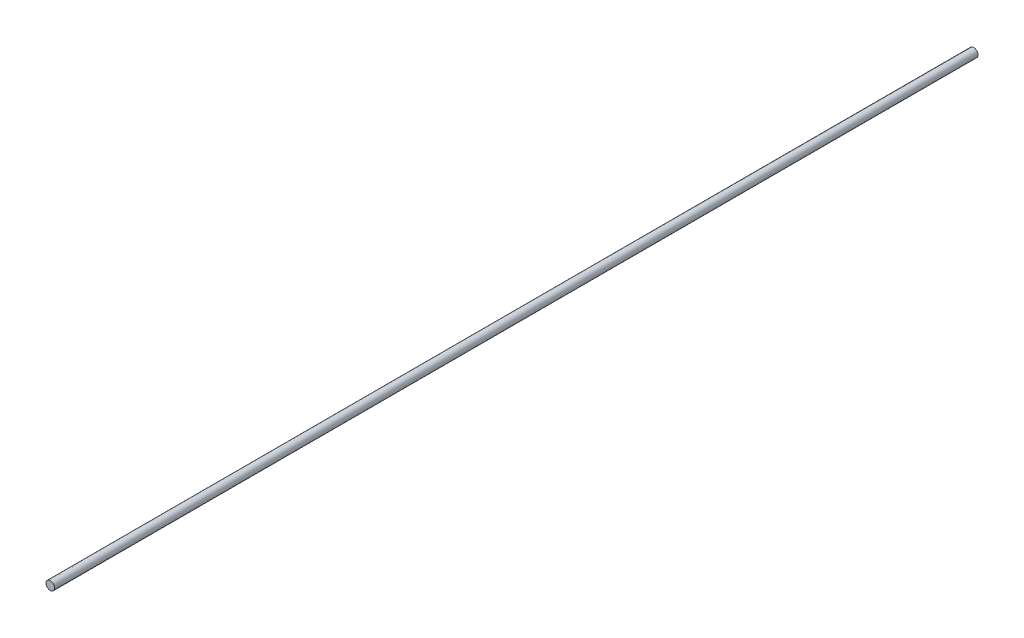
ISO-10303-21;
HEADER;
FILE_DESCRIPTION(('STEP AP214'),'2;1');
FILE_NAME('part.step','',(''),(''),'','','');
FILE_SCHEMA(('AUTOMOTIVE_DESIGN { 1 0 10303 214 1 1 1 1 }'));
ENDSEC;
DATA;
#1=APPLICATION_CONTEXT('core data for automotive mechanical design processes');
#2=APPLICATION_PROTOCOL_DEFINITION('international standard','automotive_design',2000,#1);
#3=PRODUCT_CONTEXT('',#1,'mechanical');
#4=PRODUCT('Part','Part','',(#3));
#5=PRODUCT_RELATED_PRODUCT_CATEGORY('part','',(#4));
#6=PRODUCT_DEFINITION_FORMATION('','',#4);
#7=PRODUCT_DEFINITION_CONTEXT('part definition',#1,'design');
#8=PRODUCT_DEFINITION('design','',#6,#7);
#9=PRODUCT_DEFINITION_SHAPE('','',#8);
#10=(LENGTH_UNIT() NAMED_UNIT(*) SI_UNIT(.MILLI.,.METRE.));
#11=(NAMED_UNIT(*) PLANE_ANGLE_UNIT() SI_UNIT($,.RADIAN.));
#12=(NAMED_UNIT(*) SI_UNIT($,.STERADIAN.) SOLID_ANGLE_UNIT());
#13=UNCERTAINTY_MEASURE_WITH_UNIT(LENGTH_MEASURE(1.E-05),#10,'distance_accuracy_value','');
#14=(GEOMETRIC_REPRESENTATION_CONTEXT(3) GLOBAL_UNCERTAINTY_ASSIGNED_CONTEXT((#13)) GLOBAL_UNIT_ASSIGNED_CONTEXT((#10,
#11,#12)) REPRESENTATION_CONTEXT('',''));
#15=CARTESIAN_POINT('',(0.,0.,0.));
#16=DIRECTION('',(0.,0.,1.));
#17=DIRECTION('',(1.,0.,0.));
#18=AXIS2_PLACEMENT_3D('',#15,#16,#17);
#19=CARTESIAN_POINT('',(0.,0.,1615.));
#20=DIRECTION('',(0.,0.,-1.));
#21=DIRECTION('',(-1.,0.,0.));
#22=AXIS2_PLACEMENT_3D('',#19,#20,#21);
#23=CYLINDRICAL_SURFACE('',#22,7.5);
#24=CARTESIAN_POINT('',(0.,0.,1615.));
#25=DIRECTION('',(0.,0.,1.));
#26=DIRECTION('',(1.,0.,0.));
#27=AXIS2_PLACEMENT_3D('',#24,#25,#26);
#28=CIRCLE('',#27,7.5);
#29=CARTESIAN_POINT('',(7.5,0.,1615.));
#30=VERTEX_POINT('',#29);
#31=EDGE_CURVE('E10',#30,#30,#28,.T.);
#32=ORIENTED_EDGE('',*,*,#31,.F.);
#33=EDGE_LOOP('',(#32));
#34=FACE_BOUND('',#33,.T.);
#35=CARTESIAN_POINT('',(0.,0.,0.));
#36=DIRECTION('',(0.,0.,1.));
#37=DIRECTION('',(1.,0.,0.));
#38=AXIS2_PLACEMENT_3D('',#35,#36,#37);
#39=CIRCLE('',#38,7.5);
#40=CARTESIAN_POINT('',(7.5,0.,0.));
#41=VERTEX_POINT('',#40);
#42=EDGE_CURVE('E35',#41,#41,#39,.T.);
#43=ORIENTED_EDGE('',*,*,#42,.T.);
#44=EDGE_LOOP('',(#43));
#45=FACE_BOUND('',#44,.T.);
#46=ADVANCED_FACE('F32',(#34,#45),#23,.T.);
#47=CARTESIAN_POINT('',(0.,0.,1615.));
#48=DIRECTION('',(0.,0.,1.));
#49=DIRECTION('',(1.,0.,0.));
#50=AXIS2_PLACEMENT_3D('',#47,#48,#49);
#51=PLANE('',#50);
#52=ORIENTED_EDGE('',*,*,#31,.T.);
#53=EDGE_LOOP('',(#52));
#54=FACE_BOUND('',#53,.T.);
#55=ADVANCED_FACE('F61',(#54),#51,.T.);
#56=CARTESIAN_POINT('',(0.,0.,0.));
#57=DIRECTION('',(0.,0.,1.));
#58=DIRECTION('',(1.,0.,0.));
#59=AXIS2_PLACEMENT_3D('',#56,#57,#58);
#60=PLANE('',#59);
#61=CARTESIAN_POINT('',(0.,0.,0.));
#62=DIRECTION('',(0.,0.,-1.));
#63=DIRECTION('',(-1.,0.,0.));
#64=AXIS2_PLACEMENT_3D('',#61,#62,#63);
#65=CIRCLE('',#64,4.);
#66=CARTESIAN_POINT('',(-4.,0.,0.));
#67=VERTEX_POINT('',#66);
#68=EDGE_CURVE('E44',#67,#67,#65,.T.);
#69=ORIENTED_EDGE('',*,*,#68,.F.);
#70=EDGE_LOOP('',(#69));
#71=FACE_BOUND('',#70,.T.);
#72=ORIENTED_EDGE('',*,*,#42,.F.);
#73=EDGE_LOOP('',(#72));
#74=FACE_BOUND('',#73,.T.);
#75=ADVANCED_FACE('F55',(#71,#74),#60,.F.);
#76=CARTESIAN_POINT('',(0.,0.,40.));
#77=DIRECTION('',(0.,0.,-1.));
#78=DIRECTION('',(-1.,0.,0.));
#79=AXIS2_PLACEMENT_3D('',#76,#77,#78);
#80=CYLINDRICAL_SURFACE('',#79,4.);
#81=CARTESIAN_POINT('',(0.,0.,40.));
#82=DIRECTION('',(0.,0.,-1.));
#83=DIRECTION('',(-1.,0.,0.));
#84=AXIS2_PLACEMENT_3D('',#81,#82,#83);
#85=CIRCLE('',#84,4.);
#86=CARTESIAN_POINT('',(-4.,0.,40.));
#87=VERTEX_POINT('',#86);
#88=EDGE_CURVE('E42',#87,#87,#85,.T.);
#89=ORIENTED_EDGE('',*,*,#88,.F.);
#90=EDGE_LOOP('',(#89));
#91=FACE_BOUND('',#90,.T.);
#92=ORIENTED_EDGE('',*,*,#68,.T.);
#93=EDGE_LOOP('',(#92));
#94=FACE_BOUND('',#93,.T.);
#95=ADVANCED_FACE('F52',(#91,#94),#80,.F.);
#96=CARTESIAN_POINT('',(0.,0.,40.));
#97=DIRECTION('',(0.,0.,-1.));
#98=DIRECTION('',(-1.,0.,0.));
#99=AXIS2_PLACEMENT_3D('',#96,#97,#98);
#100=PLANE('',#99);
#101=ORIENTED_EDGE('',*,*,#88,.T.);
#102=EDGE_LOOP('',(#101));
#103=FACE_BOUND('',#102,.T.);
#104=ADVANCED_FACE('F50',(#103),#100,.T.);
#105=CLOSED_SHELL('',(#46,#55,#75,#95,#104));
#106=MANIFOLD_SOLID_BREP('B2',#105);
#107=ADVANCED_BREP_SHAPE_REPRESENTATION('',(#18,#106),#14);
#108=SHAPE_DEFINITION_REPRESENTATION(#9,#107);
ENDSEC;
END-ISO-10303-21;
